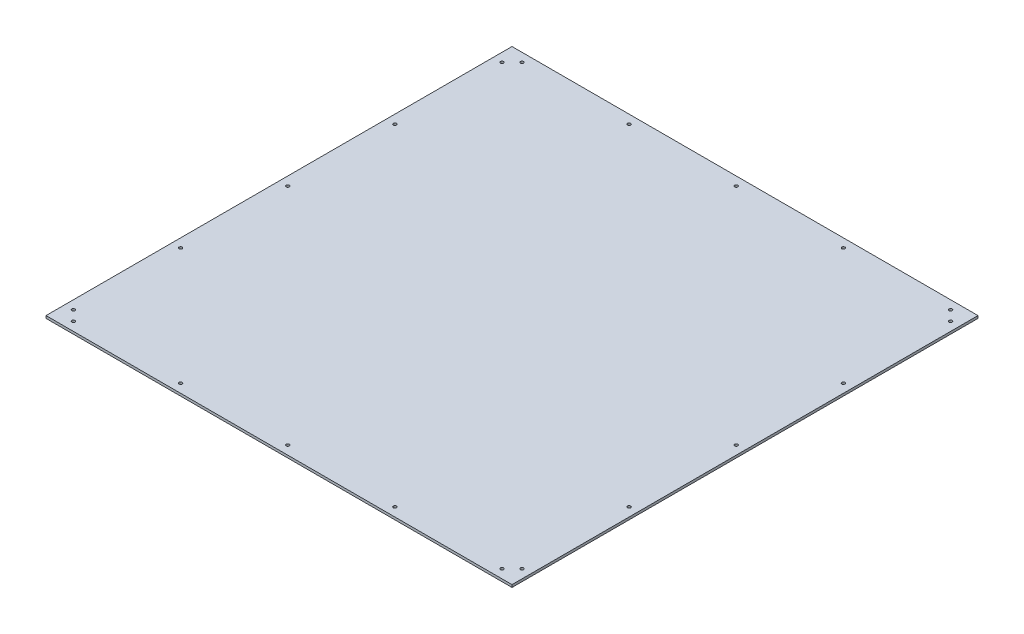
ISO-10303-21;
HEADER;
FILE_DESCRIPTION(('STEP AP214'),'2;1');
FILE_NAME('part.step','',(''),(''),'','','');
FILE_SCHEMA(('AUTOMOTIVE_DESIGN { 1 0 10303 214 1 1 1 1 }'));
ENDSEC;
DATA;
#1=APPLICATION_CONTEXT('core data for automotive mechanical design processes');
#2=APPLICATION_PROTOCOL_DEFINITION('international standard','automotive_design',2000,#1);
#3=PRODUCT_CONTEXT('',#1,'mechanical');
#4=PRODUCT('Part','Part','',(#3));
#5=PRODUCT_RELATED_PRODUCT_CATEGORY('part','',(#4));
#6=PRODUCT_DEFINITION_FORMATION('','',#4);
#7=PRODUCT_DEFINITION_CONTEXT('part definition',#1,'design');
#8=PRODUCT_DEFINITION('design','',#6,#7);
#9=PRODUCT_DEFINITION_SHAPE('','',#8);
#10=(LENGTH_UNIT() NAMED_UNIT(*) SI_UNIT(.MILLI.,.METRE.));
#11=(NAMED_UNIT(*) PLANE_ANGLE_UNIT() SI_UNIT($,.RADIAN.));
#12=(NAMED_UNIT(*) SI_UNIT($,.STERADIAN.) SOLID_ANGLE_UNIT());
#13=UNCERTAINTY_MEASURE_WITH_UNIT(LENGTH_MEASURE(1.E-05),#10,'distance_accuracy_value','');
#14=(GEOMETRIC_REPRESENTATION_CONTEXT(3) GLOBAL_UNCERTAINTY_ASSIGNED_CONTEXT((#13)) GLOBAL_UNIT_ASSIGNED_CONTEXT((#10,
#11,#12)) REPRESENTATION_CONTEXT('',''));
#15=CARTESIAN_POINT('',(0.,0.,0.));
#16=DIRECTION('',(0.,0.,1.));
#17=DIRECTION('',(1.,0.,0.));
#18=AXIS2_PLACEMENT_3D('',#15,#16,#17);
#19=CARTESIAN_POINT('',(0.,4.,0.));
#20=DIRECTION('',(0.,-1.,0.));
#21=DIRECTION('',(0.,0.,-1.));
#22=AXIS2_PLACEMENT_3D('',#19,#20,#21);
#23=PLANE('',#22);
#24=DIRECTION('',(0.,0.,-1.));
#25=VECTOR('',#24,1.);
#26=CARTESIAN_POINT('',(374.,4.,374.));
#27=LINE('',#26,#25);
#28=CARTESIAN_POINT('',(374.,4.,374.));
#29=VERTEX_POINT('',#28);
#30=CARTESIAN_POINT('',(374.,4.,-374.));
#31=VERTEX_POINT('',#30);
#32=EDGE_CURVE('E96',#29,#31,#27,.T.);
#33=ORIENTED_EDGE('',*,*,#32,.T.);
#34=DIRECTION('',(-1.,0.,0.));
#35=VECTOR('',#34,1.);
#36=CARTESIAN_POINT('',(-374.,4.,-374.));
#37=LINE('',#36,#35);
#38=CARTESIAN_POINT('',(-374.,4.,-374.));
#39=VERTEX_POINT('',#38);
#40=EDGE_CURVE('E91',#31,#39,#37,.T.);
#41=ORIENTED_EDGE('',*,*,#40,.T.);
#42=DIRECTION('',(0.,0.,1.));
#43=VECTOR('',#42,1.);
#44=CARTESIAN_POINT('',(-374.,4.,374.));
#45=LINE('',#44,#43);
#46=CARTESIAN_POINT('',(-374.,4.,374.));
#47=VERTEX_POINT('',#46);
#48=EDGE_CURVE('E94',#39,#47,#45,.T.);
#49=ORIENTED_EDGE('',*,*,#48,.T.);
#50=DIRECTION('',(1.,0.,0.));
#51=VECTOR('',#50,1.);
#52=CARTESIAN_POINT('',(-374.,4.,374.));
#53=LINE('',#52,#51);
#54=EDGE_CURVE('E61',#47,#29,#53,.T.);
#55=ORIENTED_EDGE('',*,*,#54,.T.);
#56=EDGE_LOOP('',(#33,#41,#49,#55));
#57=FACE_BOUND('',#56,.T.);
#58=CARTESIAN_POINT('',(-344.,4.,-360.));
#59=DIRECTION('',(0.,1.,0.));
#60=DIRECTION('',(0.,0.,1.));
#61=AXIS2_PLACEMENT_3D('',#58,#59,#60);
#62=CIRCLE('',#61,2.50000000000002);
#63=CARTESIAN_POINT('',(-344.,4.,-357.5));
#64=VERTEX_POINT('',#63);
#65=EDGE_CURVE('E118',#64,#64,#62,.T.);
#66=ORIENTED_EDGE('',*,*,#65,.F.);
#67=EDGE_LOOP('',(#66));
#68=FACE_BOUND('',#67,.T.);
#69=CARTESIAN_POINT('',(-172.,4.,-360.));
#70=DIRECTION('',(0.,1.,0.));
#71=DIRECTION('',(0.,0.,1.));
#72=AXIS2_PLACEMENT_3D('',#69,#70,#71);
#73=CIRCLE('',#72,2.5);
#74=CARTESIAN_POINT('',(-172.,4.,-357.5));
#75=VERTEX_POINT('',#74);
#76=EDGE_CURVE('E144',#75,#75,#73,.T.);
#77=ORIENTED_EDGE('',*,*,#76,.F.);
#78=EDGE_LOOP('',(#77));
#79=FACE_BOUND('',#78,.T.);
#80=CARTESIAN_POINT('',(0.,4.,-360.));
#81=DIRECTION('',(0.,1.,0.));
#82=DIRECTION('',(0.,0.,1.));
#83=AXIS2_PLACEMENT_3D('',#80,#81,#82);
#84=CIRCLE('',#83,2.5);
#85=CARTESIAN_POINT('',(0.,4.,-357.5));
#86=VERTEX_POINT('',#85);
#87=EDGE_CURVE('E152',#86,#86,#84,.T.);
#88=ORIENTED_EDGE('',*,*,#87,.F.);
#89=EDGE_LOOP('',(#88));
#90=FACE_BOUND('',#89,.T.);
#91=CARTESIAN_POINT('',(-360.,4.,1.11022302462516E-13));
#92=DIRECTION('',(0.,1.,0.));
#93=DIRECTION('',(0.,0.,-1.));
#94=AXIS2_PLACEMENT_3D('',#91,#92,#93);
#95=CIRCLE('',#94,2.50000000000002);
#96=CARTESIAN_POINT('',(-360.,4.,-2.49999999999991));
#97=VERTEX_POINT('',#96);
#98=EDGE_CURVE('E160',#97,#97,#95,.T.);
#99=ORIENTED_EDGE('',*,*,#98,.F.);
#100=EDGE_LOOP('',(#99));
#101=FACE_BOUND('',#100,.T.);
#102=CARTESIAN_POINT('',(-360.,4.,-172.));
#103=DIRECTION('',(0.,1.,0.));
#104=DIRECTION('',(0.,0.,-1.));
#105=AXIS2_PLACEMENT_3D('',#102,#103,#104);
#106=CIRCLE('',#105,2.50000000000002);
#107=CARTESIAN_POINT('',(-360.,4.,-174.5));
#108=VERTEX_POINT('',#107);
#109=EDGE_CURVE('E168',#108,#108,#106,.T.);
#110=ORIENTED_EDGE('',*,*,#109,.F.);
#111=EDGE_LOOP('',(#110));
#112=FACE_BOUND('',#111,.T.);
#113=CARTESIAN_POINT('',(-360.,4.,-343.999999999999));
#114=DIRECTION('',(0.,1.,0.));
#115=DIRECTION('',(0.,0.,-1.));
#116=AXIS2_PLACEMENT_3D('',#113,#114,#115);
#117=CIRCLE('',#116,2.50000000000002);
#118=CARTESIAN_POINT('',(-360.,4.,-346.499999999999));
#119=VERTEX_POINT('',#118);
#120=EDGE_CURVE('E176',#119,#119,#117,.T.);
#121=ORIENTED_EDGE('',*,*,#120,.F.);
#122=EDGE_LOOP('',(#121));
#123=FACE_BOUND('',#122,.T.);
#124=CARTESIAN_POINT('',(360.,4.,0.));
#125=DIRECTION('',(0.,1.,0.));
#126=DIRECTION('',(0.,0.,1.));
#127=AXIS2_PLACEMENT_3D('',#124,#125,#126);
#128=CIRCLE('',#127,2.50000000000002);
#129=CARTESIAN_POINT('',(360.,4.,2.50000000000004));
#130=VERTEX_POINT('',#129);
#131=EDGE_CURVE('E184',#130,#130,#128,.T.);
#132=ORIENTED_EDGE('',*,*,#131,.F.);
#133=EDGE_LOOP('',(#132));
#134=FACE_BOUND('',#133,.T.);
#135=CARTESIAN_POINT('',(172.,4.,-360.));
#136=DIRECTION('',(0.,1.,0.));
#137=DIRECTION('',(0.,0.,-1.));
#138=AXIS2_PLACEMENT_3D('',#135,#136,#137);
#139=CIRCLE('',#138,2.5);
#140=CARTESIAN_POINT('',(172.,4.,-362.5));
#141=VERTEX_POINT('',#140);
#142=EDGE_CURVE('E192',#141,#141,#139,.T.);
#143=ORIENTED_EDGE('',*,*,#142,.F.);
#144=EDGE_LOOP('',(#143));
#145=FACE_BOUND('',#144,.T.);
#146=CARTESIAN_POINT('',(360.,4.,-344.));
#147=DIRECTION('',(0.,1.,0.));
#148=DIRECTION('',(0.,0.,1.));
#149=AXIS2_PLACEMENT_3D('',#146,#147,#148);
#150=CIRCLE('',#149,2.50000000000002);
#151=CARTESIAN_POINT('',(360.,4.,-341.5));
#152=VERTEX_POINT('',#151);
#153=EDGE_CURVE('E200',#152,#152,#150,.T.);
#154=ORIENTED_EDGE('',*,*,#153,.F.);
#155=EDGE_LOOP('',(#154));
#156=FACE_BOUND('',#155,.T.);
#157=CARTESIAN_POINT('',(360.,4.,-172.));
#158=DIRECTION('',(0.,1.,0.));
#159=DIRECTION('',(0.,0.,1.));
#160=AXIS2_PLACEMENT_3D('',#157,#158,#159);
#161=CIRCLE('',#160,2.50000000000002);
#162=CARTESIAN_POINT('',(360.,4.,-169.5));
#163=VERTEX_POINT('',#162);
#164=EDGE_CURVE('E208',#163,#163,#161,.T.);
#165=ORIENTED_EDGE('',*,*,#164,.F.);
#166=EDGE_LOOP('',(#165));
#167=FACE_BOUND('',#166,.T.);
#168=CARTESIAN_POINT('',(344.,4.,-360.));
#169=DIRECTION('',(0.,1.,0.));
#170=DIRECTION('',(0.,0.,-1.));
#171=AXIS2_PLACEMENT_3D('',#168,#169,#170);
#172=CIRCLE('',#171,2.50000000000002);
#173=CARTESIAN_POINT('',(344.,4.,-362.5));
#174=VERTEX_POINT('',#173);
#175=EDGE_CURVE('E216',#174,#174,#172,.T.);
#176=ORIENTED_EDGE('',*,*,#175,.F.);
#177=EDGE_LOOP('',(#176));
#178=FACE_BOUND('',#177,.T.);
#179=CARTESIAN_POINT('',(360.,4.,172.));
#180=DIRECTION('',(0.,1.,0.));
#181=DIRECTION('',(0.,0.,-1.));
#182=AXIS2_PLACEMENT_3D('',#179,#180,#181);
#183=CIRCLE('',#182,2.50000000000002);
#184=CARTESIAN_POINT('',(360.,4.,169.5));
#185=VERTEX_POINT('',#184);
#186=EDGE_CURVE('E224',#185,#185,#183,.T.);
#187=ORIENTED_EDGE('',*,*,#186,.F.);
#188=EDGE_LOOP('',(#187));
#189=FACE_BOUND('',#188,.T.);
#190=CARTESIAN_POINT('',(360.,4.,344.));
#191=DIRECTION('',(0.,1.,0.));
#192=DIRECTION('',(0.,0.,-1.));
#193=AXIS2_PLACEMENT_3D('',#190,#191,#192);
#194=CIRCLE('',#193,2.50000000000002);
#195=CARTESIAN_POINT('',(360.,4.,341.5));
#196=VERTEX_POINT('',#195);
#197=EDGE_CURVE('E232',#196,#196,#194,.T.);
#198=ORIENTED_EDGE('',*,*,#197,.F.);
#199=EDGE_LOOP('',(#198));
#200=FACE_BOUND('',#199,.T.);
#201=CARTESIAN_POINT('',(344.,4.,360.));
#202=DIRECTION('',(0.,1.,0.));
#203=DIRECTION('',(0.,0.,1.));
#204=AXIS2_PLACEMENT_3D('',#201,#202,#203);
#205=CIRCLE('',#204,2.50000000000002);
#206=CARTESIAN_POINT('',(344.,4.,362.5));
#207=VERTEX_POINT('',#206);
#208=EDGE_CURVE('E240',#207,#207,#205,.T.);
#209=ORIENTED_EDGE('',*,*,#208,.F.);
#210=EDGE_LOOP('',(#209));
#211=FACE_BOUND('',#210,.T.);
#212=CARTESIAN_POINT('',(172.,4.,360.));
#213=DIRECTION('',(0.,1.,0.));
#214=DIRECTION('',(0.,0.,1.));
#215=AXIS2_PLACEMENT_3D('',#212,#213,#214);
#216=CIRCLE('',#215,2.5);
#217=CARTESIAN_POINT('',(172.,4.,362.5));
#218=VERTEX_POINT('',#217);
#219=EDGE_CURVE('E248',#218,#218,#216,.T.);
#220=ORIENTED_EDGE('',*,*,#219,.F.);
#221=EDGE_LOOP('',(#220));
#222=FACE_BOUND('',#221,.T.);
#223=CARTESIAN_POINT('',(0.,4.,360.));
#224=DIRECTION('',(0.,1.,0.));
#225=DIRECTION('',(0.,0.,-1.));
#226=AXIS2_PLACEMENT_3D('',#223,#224,#225);
#227=CIRCLE('',#226,2.5);
#228=CARTESIAN_POINT('',(0.,4.,357.5));
#229=VERTEX_POINT('',#228);
#230=EDGE_CURVE('E256',#229,#229,#227,.T.);
#231=ORIENTED_EDGE('',*,*,#230,.F.);
#232=EDGE_LOOP('',(#231));
#233=FACE_BOUND('',#232,.T.);
#234=CARTESIAN_POINT('',(-172.,4.,360.));
#235=DIRECTION('',(0.,1.,0.));
#236=DIRECTION('',(0.,0.,-1.));
#237=AXIS2_PLACEMENT_3D('',#234,#235,#236);
#238=CIRCLE('',#237,2.5);
#239=CARTESIAN_POINT('',(-172.,4.,357.5));
#240=VERTEX_POINT('',#239);
#241=EDGE_CURVE('E264',#240,#240,#238,.T.);
#242=ORIENTED_EDGE('',*,*,#241,.F.);
#243=EDGE_LOOP('',(#242));
#244=FACE_BOUND('',#243,.T.);
#245=CARTESIAN_POINT('',(-344.,4.,360.));
#246=DIRECTION('',(0.,1.,0.));
#247=DIRECTION('',(0.,0.,-1.));
#248=AXIS2_PLACEMENT_3D('',#245,#246,#247);
#249=CIRCLE('',#248,2.50000000000002);
#250=CARTESIAN_POINT('',(-344.,4.,357.5));
#251=VERTEX_POINT('',#250);
#252=EDGE_CURVE('E272',#251,#251,#249,.T.);
#253=ORIENTED_EDGE('',*,*,#252,.F.);
#254=EDGE_LOOP('',(#253));
#255=FACE_BOUND('',#254,.T.);
#256=CARTESIAN_POINT('',(-360.,4.,343.999999999999));
#257=DIRECTION('',(0.,1.,0.));
#258=DIRECTION('',(0.,0.,1.));
#259=AXIS2_PLACEMENT_3D('',#256,#257,#258);
#260=CIRCLE('',#259,2.50000000000002);
#261=CARTESIAN_POINT('',(-360.,4.,346.499999999999));
#262=VERTEX_POINT('',#261);
#263=EDGE_CURVE('E280',#262,#262,#260,.T.);
#264=ORIENTED_EDGE('',*,*,#263,.F.);
#265=EDGE_LOOP('',(#264));
#266=FACE_BOUND('',#265,.T.);
#267=CARTESIAN_POINT('',(-360.,4.,172.));
#268=DIRECTION('',(0.,1.,0.));
#269=DIRECTION('',(0.,0.,1.));
#270=AXIS2_PLACEMENT_3D('',#267,#268,#269);
#271=CIRCLE('',#270,2.50000000000002);
#272=CARTESIAN_POINT('',(-360.,4.,174.5));
#273=VERTEX_POINT('',#272);
#274=EDGE_CURVE('E288',#273,#273,#271,.T.);
#275=ORIENTED_EDGE('',*,*,#274,.F.);
#276=EDGE_LOOP('',(#275));
#277=FACE_BOUND('',#276,.T.);
#278=ADVANCED_FACE('F43',(#57,#68,#79,#90,#101,#112,#123,#134,#145,#156,#167,#178,#189,#200,
#211,#222,#233,#244,#255,#266,#277),#23,.F.);
#279=CARTESIAN_POINT('',(0.,0.,0.));
#280=DIRECTION('',(0.,-1.,0.));
#281=DIRECTION('',(0.,0.,-1.));
#282=AXIS2_PLACEMENT_3D('',#279,#280,#281);
#283=PLANE('',#282);
#284=CARTESIAN_POINT('',(-360.,0.,343.999999999999));
#285=DIRECTION('',(0.,1.,0.));
#286=DIRECTION('',(0.,0.,1.));
#287=AXIS2_PLACEMENT_3D('',#284,#285,#286);
#288=CIRCLE('',#287,2.50000000000002);
#289=CARTESIAN_POINT('',(-360.,0.,346.499999999999));
#290=VERTEX_POINT('',#289);
#291=EDGE_CURVE('E284',#290,#290,#288,.T.);
#292=ORIENTED_EDGE('',*,*,#291,.T.);
#293=EDGE_LOOP('',(#292));
#294=FACE_BOUND('',#293,.T.);
#295=CARTESIAN_POINT('',(-172.,0.,360.));
#296=DIRECTION('',(0.,1.,0.));
#297=DIRECTION('',(0.,0.,-1.));
#298=AXIS2_PLACEMENT_3D('',#295,#296,#297);
#299=CIRCLE('',#298,2.5);
#300=CARTESIAN_POINT('',(-172.,0.,357.5));
#301=VERTEX_POINT('',#300);
#302=EDGE_CURVE('E268',#301,#301,#299,.T.);
#303=ORIENTED_EDGE('',*,*,#302,.T.);
#304=EDGE_LOOP('',(#303));
#305=FACE_BOUND('',#304,.T.);
#306=CARTESIAN_POINT('',(172.,0.,360.));
#307=DIRECTION('',(0.,1.,0.));
#308=DIRECTION('',(0.,0.,1.));
#309=AXIS2_PLACEMENT_3D('',#306,#307,#308);
#310=CIRCLE('',#309,2.5);
#311=CARTESIAN_POINT('',(172.,0.,362.5));
#312=VERTEX_POINT('',#311);
#313=EDGE_CURVE('E252',#312,#312,#310,.T.);
#314=ORIENTED_EDGE('',*,*,#313,.T.);
#315=EDGE_LOOP('',(#314));
#316=FACE_BOUND('',#315,.T.);
#317=CARTESIAN_POINT('',(360.,0.,344.));
#318=DIRECTION('',(0.,1.,0.));
#319=DIRECTION('',(0.,0.,-1.));
#320=AXIS2_PLACEMENT_3D('',#317,#318,#319);
#321=CIRCLE('',#320,2.50000000000002);
#322=CARTESIAN_POINT('',(360.,0.,341.5));
#323=VERTEX_POINT('',#322);
#324=EDGE_CURVE('E236',#323,#323,#321,.T.);
#325=ORIENTED_EDGE('',*,*,#324,.T.);
#326=EDGE_LOOP('',(#325));
#327=FACE_BOUND('',#326,.T.);
#328=CARTESIAN_POINT('',(344.,0.,-360.));
#329=DIRECTION('',(0.,1.,0.));
#330=DIRECTION('',(0.,0.,-1.));
#331=AXIS2_PLACEMENT_3D('',#328,#329,#330);
#332=CIRCLE('',#331,2.50000000000002);
#333=CARTESIAN_POINT('',(344.,0.,-362.5));
#334=VERTEX_POINT('',#333);
#335=EDGE_CURVE('E220',#334,#334,#332,.T.);
#336=ORIENTED_EDGE('',*,*,#335,.T.);
#337=EDGE_LOOP('',(#336));
#338=FACE_BOUND('',#337,.T.);
#339=CARTESIAN_POINT('',(360.,0.,-344.));
#340=DIRECTION('',(0.,1.,0.));
#341=DIRECTION('',(0.,0.,1.));
#342=AXIS2_PLACEMENT_3D('',#339,#340,#341);
#343=CIRCLE('',#342,2.50000000000002);
#344=CARTESIAN_POINT('',(360.,0.,-341.5));
#345=VERTEX_POINT('',#344);
#346=EDGE_CURVE('E204',#345,#345,#343,.T.);
#347=ORIENTED_EDGE('',*,*,#346,.T.);
#348=EDGE_LOOP('',(#347));
#349=FACE_BOUND('',#348,.T.);
#350=CARTESIAN_POINT('',(360.,0.,0.));
#351=DIRECTION('',(0.,1.,0.));
#352=DIRECTION('',(0.,0.,1.));
#353=AXIS2_PLACEMENT_3D('',#350,#351,#352);
#354=CIRCLE('',#353,2.50000000000002);
#355=CARTESIAN_POINT('',(360.,0.,2.50000000000004));
#356=VERTEX_POINT('',#355);
#357=EDGE_CURVE('E188',#356,#356,#354,.T.);
#358=ORIENTED_EDGE('',*,*,#357,.T.);
#359=EDGE_LOOP('',(#358));
#360=FACE_BOUND('',#359,.T.);
#361=CARTESIAN_POINT('',(-360.,0.,-172.));
#362=DIRECTION('',(0.,1.,0.));
#363=DIRECTION('',(0.,0.,-1.));
#364=AXIS2_PLACEMENT_3D('',#361,#362,#363);
#365=CIRCLE('',#364,2.50000000000002);
#366=CARTESIAN_POINT('',(-360.,0.,-174.5));
#367=VERTEX_POINT('',#366);
#368=EDGE_CURVE('E172',#367,#367,#365,.T.);
#369=ORIENTED_EDGE('',*,*,#368,.T.);
#370=EDGE_LOOP('',(#369));
#371=FACE_BOUND('',#370,.T.);
#372=CARTESIAN_POINT('',(0.,0.,-360.));
#373=DIRECTION('',(0.,1.,0.));
#374=DIRECTION('',(0.,0.,1.));
#375=AXIS2_PLACEMENT_3D('',#372,#373,#374);
#376=CIRCLE('',#375,2.5);
#377=CARTESIAN_POINT('',(0.,0.,-357.5));
#378=VERTEX_POINT('',#377);
#379=EDGE_CURVE('E156',#378,#378,#376,.T.);
#380=ORIENTED_EDGE('',*,*,#379,.T.);
#381=EDGE_LOOP('',(#380));
#382=FACE_BOUND('',#381,.T.);
#383=CARTESIAN_POINT('',(-344.,0.,-360.));
#384=DIRECTION('',(0.,1.,0.));
#385=DIRECTION('',(0.,0.,1.));
#386=AXIS2_PLACEMENT_3D('',#383,#384,#385);
#387=CIRCLE('',#386,2.50000000000002);
#388=CARTESIAN_POINT('',(-344.,0.,-357.5));
#389=VERTEX_POINT('',#388);
#390=EDGE_CURVE('E140',#389,#389,#387,.T.);
#391=ORIENTED_EDGE('',*,*,#390,.T.);
#392=EDGE_LOOP('',(#391));
#393=FACE_BOUND('',#392,.T.);
#394=DIRECTION('',(0.,0.,-1.));
#395=VECTOR('',#394,1.);
#396=CARTESIAN_POINT('',(374.,0.,374.));
#397=LINE('',#396,#395);
#398=CARTESIAN_POINT('',(374.,0.,374.));
#399=VERTEX_POINT('',#398);
#400=CARTESIAN_POINT('',(374.,0.,-374.));
#401=VERTEX_POINT('',#400);
#402=EDGE_CURVE('E114',#399,#401,#397,.T.);
#403=ORIENTED_EDGE('',*,*,#402,.F.);
#404=DIRECTION('',(1.,0.,0.));
#405=VECTOR('',#404,1.);
#406=CARTESIAN_POINT('',(-374.,0.,374.));
#407=LINE('',#406,#405);
#408=CARTESIAN_POINT('',(-374.,0.,374.));
#409=VERTEX_POINT('',#408);
#410=EDGE_CURVE('E84',#409,#399,#407,.T.);
#411=ORIENTED_EDGE('',*,*,#410,.F.);
#412=DIRECTION('',(0.,0.,1.));
#413=VECTOR('',#412,1.);
#414=CARTESIAN_POINT('',(-374.,0.,374.));
#415=LINE('',#414,#413);
#416=CARTESIAN_POINT('',(-374.,0.,-374.));
#417=VERTEX_POINT('',#416);
#418=EDGE_CURVE('E78',#417,#409,#415,.T.);
#419=ORIENTED_EDGE('',*,*,#418,.F.);
#420=DIRECTION('',(-1.,0.,0.));
#421=VECTOR('',#420,1.);
#422=CARTESIAN_POINT('',(-374.,0.,-374.));
#423=LINE('',#422,#421);
#424=EDGE_CURVE('E101',#401,#417,#423,.T.);
#425=ORIENTED_EDGE('',*,*,#424,.F.);
#426=EDGE_LOOP('',(#403,#411,#419,#425));
#427=FACE_BOUND('',#426,.T.);
#428=CARTESIAN_POINT('',(-172.,0.,-360.));
#429=DIRECTION('',(0.,1.,0.));
#430=DIRECTION('',(0.,0.,1.));
#431=AXIS2_PLACEMENT_3D('',#428,#429,#430);
#432=CIRCLE('',#431,2.5);
#433=CARTESIAN_POINT('',(-172.,0.,-357.5));
#434=VERTEX_POINT('',#433);
#435=EDGE_CURVE('E148',#434,#434,#432,.T.);
#436=ORIENTED_EDGE('',*,*,#435,.T.);
#437=EDGE_LOOP('',(#436));
#438=FACE_BOUND('',#437,.T.);
#439=CARTESIAN_POINT('',(-360.,0.,1.11022302462516E-13));
#440=DIRECTION('',(0.,1.,0.));
#441=DIRECTION('',(0.,0.,-1.));
#442=AXIS2_PLACEMENT_3D('',#439,#440,#441);
#443=CIRCLE('',#442,2.50000000000002);
#444=CARTESIAN_POINT('',(-360.,0.,-2.49999999999991));
#445=VERTEX_POINT('',#444);
#446=EDGE_CURVE('E164',#445,#445,#443,.T.);
#447=ORIENTED_EDGE('',*,*,#446,.T.);
#448=EDGE_LOOP('',(#447));
#449=FACE_BOUND('',#448,.T.);
#450=CARTESIAN_POINT('',(-360.,0.,-343.999999999999));
#451=DIRECTION('',(0.,1.,0.));
#452=DIRECTION('',(0.,0.,-1.));
#453=AXIS2_PLACEMENT_3D('',#450,#451,#452);
#454=CIRCLE('',#453,2.50000000000002);
#455=CARTESIAN_POINT('',(-360.,0.,-346.499999999999));
#456=VERTEX_POINT('',#455);
#457=EDGE_CURVE('E180',#456,#456,#454,.T.);
#458=ORIENTED_EDGE('',*,*,#457,.T.);
#459=EDGE_LOOP('',(#458));
#460=FACE_BOUND('',#459,.T.);
#461=CARTESIAN_POINT('',(172.,0.,-360.));
#462=DIRECTION('',(0.,1.,0.));
#463=DIRECTION('',(0.,0.,-1.));
#464=AXIS2_PLACEMENT_3D('',#461,#462,#463);
#465=CIRCLE('',#464,2.5);
#466=CARTESIAN_POINT('',(172.,0.,-362.5));
#467=VERTEX_POINT('',#466);
#468=EDGE_CURVE('E196',#467,#467,#465,.T.);
#469=ORIENTED_EDGE('',*,*,#468,.T.);
#470=EDGE_LOOP('',(#469));
#471=FACE_BOUND('',#470,.T.);
#472=CARTESIAN_POINT('',(360.,0.,-172.));
#473=DIRECTION('',(0.,1.,0.));
#474=DIRECTION('',(0.,0.,1.));
#475=AXIS2_PLACEMENT_3D('',#472,#473,#474);
#476=CIRCLE('',#475,2.50000000000002);
#477=CARTESIAN_POINT('',(360.,0.,-169.5));
#478=VERTEX_POINT('',#477);
#479=EDGE_CURVE('E212',#478,#478,#476,.T.);
#480=ORIENTED_EDGE('',*,*,#479,.T.);
#481=EDGE_LOOP('',(#480));
#482=FACE_BOUND('',#481,.T.);
#483=CARTESIAN_POINT('',(360.,0.,172.));
#484=DIRECTION('',(0.,1.,0.));
#485=DIRECTION('',(0.,0.,-1.));
#486=AXIS2_PLACEMENT_3D('',#483,#484,#485);
#487=CIRCLE('',#486,2.50000000000002);
#488=CARTESIAN_POINT('',(360.,0.,169.5));
#489=VERTEX_POINT('',#488);
#490=EDGE_CURVE('E228',#489,#489,#487,.T.);
#491=ORIENTED_EDGE('',*,*,#490,.T.);
#492=EDGE_LOOP('',(#491));
#493=FACE_BOUND('',#492,.T.);
#494=CARTESIAN_POINT('',(344.,0.,360.));
#495=DIRECTION('',(0.,1.,0.));
#496=DIRECTION('',(0.,0.,1.));
#497=AXIS2_PLACEMENT_3D('',#494,#495,#496);
#498=CIRCLE('',#497,2.50000000000002);
#499=CARTESIAN_POINT('',(344.,0.,362.5));
#500=VERTEX_POINT('',#499);
#501=EDGE_CURVE('E244',#500,#500,#498,.T.);
#502=ORIENTED_EDGE('',*,*,#501,.T.);
#503=EDGE_LOOP('',(#502));
#504=FACE_BOUND('',#503,.T.);
#505=CARTESIAN_POINT('',(0.,0.,360.));
#506=DIRECTION('',(0.,1.,0.));
#507=DIRECTION('',(0.,0.,-1.));
#508=AXIS2_PLACEMENT_3D('',#505,#506,#507);
#509=CIRCLE('',#508,2.5);
#510=CARTESIAN_POINT('',(0.,0.,357.5));
#511=VERTEX_POINT('',#510);
#512=EDGE_CURVE('E260',#511,#511,#509,.T.);
#513=ORIENTED_EDGE('',*,*,#512,.T.);
#514=EDGE_LOOP('',(#513));
#515=FACE_BOUND('',#514,.T.);
#516=CARTESIAN_POINT('',(-344.,0.,360.));
#517=DIRECTION('',(0.,1.,0.));
#518=DIRECTION('',(0.,0.,-1.));
#519=AXIS2_PLACEMENT_3D('',#516,#517,#518);
#520=CIRCLE('',#519,2.50000000000002);
#521=CARTESIAN_POINT('',(-344.,0.,357.5));
#522=VERTEX_POINT('',#521);
#523=EDGE_CURVE('E276',#522,#522,#520,.T.);
#524=ORIENTED_EDGE('',*,*,#523,.T.);
#525=EDGE_LOOP('',(#524));
#526=FACE_BOUND('',#525,.T.);
#527=CARTESIAN_POINT('',(-360.,0.,172.));
#528=DIRECTION('',(0.,1.,0.));
#529=DIRECTION('',(0.,0.,1.));
#530=AXIS2_PLACEMENT_3D('',#527,#528,#529);
#531=CIRCLE('',#530,2.50000000000002);
#532=CARTESIAN_POINT('',(-360.,0.,174.5));
#533=VERTEX_POINT('',#532);
#534=EDGE_CURVE('E292',#533,#533,#531,.T.);
#535=ORIENTED_EDGE('',*,*,#534,.T.);
#536=EDGE_LOOP('',(#535));
#537=FACE_BOUND('',#536,.T.);
#538=ADVANCED_FACE('F133',(#294,#305,#316,#327,#338,#349,#360,#371,#382,#393,#427,#438,#449,
#460,#471,#482,#493,#504,#515,#526,#537),#283,.T.);
#539=CARTESIAN_POINT('',(374.,4.,374.));
#540=DIRECTION('',(-1.,0.,0.));
#541=DIRECTION('',(0.,0.,1.));
#542=AXIS2_PLACEMENT_3D('',#539,#540,#541);
#543=PLANE('',#542);
#544=ORIENTED_EDGE('',*,*,#402,.T.);
#545=DIRECTION('',(0.,-1.,0.));
#546=VECTOR('',#545,1.);
#547=CARTESIAN_POINT('',(374.,4.,-374.));
#548=LINE('',#547,#546);
#549=EDGE_CURVE('E11',#31,#401,#548,.T.);
#550=ORIENTED_EDGE('',*,*,#549,.F.);
#551=ORIENTED_EDGE('',*,*,#32,.F.);
#552=DIRECTION('',(0.,-1.,0.));
#553=VECTOR('',#552,1.);
#554=CARTESIAN_POINT('',(374.,4.,374.));
#555=LINE('',#554,#553);
#556=EDGE_CURVE('E110',#29,#399,#555,.T.);
#557=ORIENTED_EDGE('',*,*,#556,.T.);
#558=EDGE_LOOP('',(#544,#550,#551,#557));
#559=FACE_BOUND('',#558,.T.);
#560=ADVANCED_FACE('F45',(#559),#543,.F.);
#561=CARTESIAN_POINT('',(-374.,4.,-374.));
#562=DIRECTION('',(0.,0.,1.));
#563=DIRECTION('',(1.,0.,0.));
#564=AXIS2_PLACEMENT_3D('',#561,#562,#563);
#565=PLANE('',#564);
#566=ORIENTED_EDGE('',*,*,#424,.T.);
#567=DIRECTION('',(0.,-1.,0.));
#568=VECTOR('',#567,1.);
#569=CARTESIAN_POINT('',(-374.,4.,-374.));
#570=LINE('',#569,#568);
#571=EDGE_CURVE('E53',#39,#417,#570,.T.);
#572=ORIENTED_EDGE('',*,*,#571,.F.);
#573=ORIENTED_EDGE('',*,*,#40,.F.);
#574=ORIENTED_EDGE('',*,*,#549,.T.);
#575=EDGE_LOOP('',(#566,#572,#573,#574));
#576=FACE_BOUND('',#575,.T.);
#577=ADVANCED_FACE('F100',(#576),#565,.F.);
#578=CARTESIAN_POINT('',(-374.,4.,374.));
#579=DIRECTION('',(1.,0.,0.));
#580=DIRECTION('',(0.,0.,-1.));
#581=AXIS2_PLACEMENT_3D('',#578,#579,#580);
#582=PLANE('',#581);
#583=ORIENTED_EDGE('',*,*,#418,.T.);
#584=DIRECTION('',(0.,-1.,0.));
#585=VECTOR('',#584,1.);
#586=CARTESIAN_POINT('',(-374.,4.,374.));
#587=LINE('',#586,#585);
#588=EDGE_CURVE('E103',#47,#409,#587,.T.);
#589=ORIENTED_EDGE('',*,*,#588,.F.);
#590=ORIENTED_EDGE('',*,*,#48,.F.);
#591=ORIENTED_EDGE('',*,*,#571,.T.);
#592=EDGE_LOOP('',(#583,#589,#590,#591));
#593=FACE_BOUND('',#592,.T.);
#594=ADVANCED_FACE('F104',(#593),#582,.F.);
#595=CARTESIAN_POINT('',(-374.,4.,374.));
#596=DIRECTION('',(0.,0.,-1.));
#597=DIRECTION('',(-1.,0.,0.));
#598=AXIS2_PLACEMENT_3D('',#595,#596,#597);
#599=PLANE('',#598);
#600=ORIENTED_EDGE('',*,*,#410,.T.);
#601=ORIENTED_EDGE('',*,*,#556,.F.);
#602=ORIENTED_EDGE('',*,*,#54,.F.);
#603=ORIENTED_EDGE('',*,*,#588,.T.);
#604=EDGE_LOOP('',(#600,#601,#602,#603));
#605=FACE_BOUND('',#604,.T.);
#606=ADVANCED_FACE('F130',(#605),#599,.F.);
#607=CARTESIAN_POINT('',(-344.,4.,-360.));
#608=DIRECTION('',(0.,-1.,0.));
#609=DIRECTION('',(0.,0.,-1.));
#610=AXIS2_PLACEMENT_3D('',#607,#608,#609);
#611=CYLINDRICAL_SURFACE('',#610,2.50000000000002);
#612=ORIENTED_EDGE('',*,*,#65,.T.);
#613=EDGE_LOOP('',(#612));
#614=FACE_BOUND('',#613,.T.);
#615=ORIENTED_EDGE('',*,*,#390,.F.);
#616=EDGE_LOOP('',(#615));
#617=FACE_BOUND('',#616,.T.);
#618=ADVANCED_FACE('F313',(#614,#617),#611,.F.);
#619=CARTESIAN_POINT('',(-172.,4.,-360.));
#620=DIRECTION('',(0.,-1.,0.));
#621=DIRECTION('',(0.,0.,-1.));
#622=AXIS2_PLACEMENT_3D('',#619,#620,#621);
#623=CYLINDRICAL_SURFACE('',#622,2.5);
#624=ORIENTED_EDGE('',*,*,#76,.T.);
#625=EDGE_LOOP('',(#624));
#626=FACE_BOUND('',#625,.T.);
#627=ORIENTED_EDGE('',*,*,#435,.F.);
#628=EDGE_LOOP('',(#627));
#629=FACE_BOUND('',#628,.T.);
#630=ADVANCED_FACE('F368',(#626,#629),#623,.F.);
#631=CARTESIAN_POINT('',(0.,4.,-360.));
#632=DIRECTION('',(0.,-1.,0.));
#633=DIRECTION('',(0.,0.,-1.));
#634=AXIS2_PLACEMENT_3D('',#631,#632,#633);
#635=CYLINDRICAL_SURFACE('',#634,2.5);
#636=ORIENTED_EDGE('',*,*,#87,.T.);
#637=EDGE_LOOP('',(#636));
#638=FACE_BOUND('',#637,.T.);
#639=ORIENTED_EDGE('',*,*,#379,.F.);
#640=EDGE_LOOP('',(#639));
#641=FACE_BOUND('',#640,.T.);
#642=ADVANCED_FACE('F377',(#638,#641),#635,.F.);
#643=CARTESIAN_POINT('',(-360.,4.,1.11022302462516E-13));
#644=DIRECTION('',(0.,-1.,0.));
#645=DIRECTION('',(0.,0.,-1.));
#646=AXIS2_PLACEMENT_3D('',#643,#644,#645);
#647=CYLINDRICAL_SURFACE('',#646,2.50000000000002);
#648=ORIENTED_EDGE('',*,*,#98,.T.);
#649=EDGE_LOOP('',(#648));
#650=FACE_BOUND('',#649,.T.);
#651=ORIENTED_EDGE('',*,*,#446,.F.);
#652=EDGE_LOOP('',(#651));
#653=FACE_BOUND('',#652,.T.);
#654=ADVANCED_FACE('F386',(#650,#653),#647,.F.);
#655=CARTESIAN_POINT('',(-360.,4.,-172.));
#656=DIRECTION('',(0.,-1.,0.));
#657=DIRECTION('',(0.,0.,-1.));
#658=AXIS2_PLACEMENT_3D('',#655,#656,#657);
#659=CYLINDRICAL_SURFACE('',#658,2.50000000000002);
#660=ORIENTED_EDGE('',*,*,#109,.T.);
#661=EDGE_LOOP('',(#660));
#662=FACE_BOUND('',#661,.T.);
#663=ORIENTED_EDGE('',*,*,#368,.F.);
#664=EDGE_LOOP('',(#663));
#665=FACE_BOUND('',#664,.T.);
#666=ADVANCED_FACE('F396',(#662,#665),#659,.F.);
#667=CARTESIAN_POINT('',(-360.,4.,-343.999999999999));
#668=DIRECTION('',(0.,-1.,0.));
#669=DIRECTION('',(0.,0.,-1.));
#670=AXIS2_PLACEMENT_3D('',#667,#668,#669);
#671=CYLINDRICAL_SURFACE('',#670,2.50000000000002);
#672=ORIENTED_EDGE('',*,*,#120,.T.);
#673=EDGE_LOOP('',(#672));
#674=FACE_BOUND('',#673,.T.);
#675=ORIENTED_EDGE('',*,*,#457,.F.);
#676=EDGE_LOOP('',(#675));
#677=FACE_BOUND('',#676,.T.);
#678=ADVANCED_FACE('F406',(#674,#677),#671,.F.);
#679=CARTESIAN_POINT('',(360.,4.,0.));
#680=DIRECTION('',(0.,-1.,0.));
#681=DIRECTION('',(0.,0.,-1.));
#682=AXIS2_PLACEMENT_3D('',#679,#680,#681);
#683=CYLINDRICAL_SURFACE('',#682,2.50000000000002);
#684=ORIENTED_EDGE('',*,*,#131,.T.);
#685=EDGE_LOOP('',(#684));
#686=FACE_BOUND('',#685,.T.);
#687=ORIENTED_EDGE('',*,*,#357,.F.);
#688=EDGE_LOOP('',(#687));
#689=FACE_BOUND('',#688,.T.);
#690=ADVANCED_FACE('F416',(#686,#689),#683,.F.);
#691=CARTESIAN_POINT('',(172.,4.,-360.));
#692=DIRECTION('',(0.,-1.,0.));
#693=DIRECTION('',(0.,0.,-1.));
#694=AXIS2_PLACEMENT_3D('',#691,#692,#693);
#695=CYLINDRICAL_SURFACE('',#694,2.5);
#696=ORIENTED_EDGE('',*,*,#142,.T.);
#697=EDGE_LOOP('',(#696));
#698=FACE_BOUND('',#697,.T.);
#699=ORIENTED_EDGE('',*,*,#468,.F.);
#700=EDGE_LOOP('',(#699));
#701=FACE_BOUND('',#700,.T.);
#702=ADVANCED_FACE('F426',(#698,#701),#695,.F.);
#703=CARTESIAN_POINT('',(360.,4.,-344.));
#704=DIRECTION('',(0.,-1.,0.));
#705=DIRECTION('',(0.,0.,-1.));
#706=AXIS2_PLACEMENT_3D('',#703,#704,#705);
#707=CYLINDRICAL_SURFACE('',#706,2.50000000000002);
#708=ORIENTED_EDGE('',*,*,#153,.T.);
#709=EDGE_LOOP('',(#708));
#710=FACE_BOUND('',#709,.T.);
#711=ORIENTED_EDGE('',*,*,#346,.F.);
#712=EDGE_LOOP('',(#711));
#713=FACE_BOUND('',#712,.T.);
#714=ADVANCED_FACE('F436',(#710,#713),#707,.F.);
#715=CARTESIAN_POINT('',(360.,4.,-172.));
#716=DIRECTION('',(0.,-1.,0.));
#717=DIRECTION('',(0.,0.,-1.));
#718=AXIS2_PLACEMENT_3D('',#715,#716,#717);
#719=CYLINDRICAL_SURFACE('',#718,2.50000000000002);
#720=ORIENTED_EDGE('',*,*,#164,.T.);
#721=EDGE_LOOP('',(#720));
#722=FACE_BOUND('',#721,.T.);
#723=ORIENTED_EDGE('',*,*,#479,.F.);
#724=EDGE_LOOP('',(#723));
#725=FACE_BOUND('',#724,.T.);
#726=ADVANCED_FACE('F446',(#722,#725),#719,.F.);
#727=CARTESIAN_POINT('',(344.,4.,-360.));
#728=DIRECTION('',(0.,-1.,0.));
#729=DIRECTION('',(0.,0.,-1.));
#730=AXIS2_PLACEMENT_3D('',#727,#728,#729);
#731=CYLINDRICAL_SURFACE('',#730,2.50000000000002);
#732=ORIENTED_EDGE('',*,*,#175,.T.);
#733=EDGE_LOOP('',(#732));
#734=FACE_BOUND('',#733,.T.);
#735=ORIENTED_EDGE('',*,*,#335,.F.);
#736=EDGE_LOOP('',(#735));
#737=FACE_BOUND('',#736,.T.);
#738=ADVANCED_FACE('F456',(#734,#737),#731,.F.);
#739=CARTESIAN_POINT('',(360.,4.,172.));
#740=DIRECTION('',(0.,-1.,0.));
#741=DIRECTION('',(0.,0.,-1.));
#742=AXIS2_PLACEMENT_3D('',#739,#740,#741);
#743=CYLINDRICAL_SURFACE('',#742,2.50000000000002);
#744=ORIENTED_EDGE('',*,*,#186,.T.);
#745=EDGE_LOOP('',(#744));
#746=FACE_BOUND('',#745,.T.);
#747=ORIENTED_EDGE('',*,*,#490,.F.);
#748=EDGE_LOOP('',(#747));
#749=FACE_BOUND('',#748,.T.);
#750=ADVANCED_FACE('F466',(#746,#749),#743,.F.);
#751=CARTESIAN_POINT('',(360.,4.,344.));
#752=DIRECTION('',(0.,-1.,0.));
#753=DIRECTION('',(0.,0.,-1.));
#754=AXIS2_PLACEMENT_3D('',#751,#752,#753);
#755=CYLINDRICAL_SURFACE('',#754,2.50000000000002);
#756=ORIENTED_EDGE('',*,*,#197,.T.);
#757=EDGE_LOOP('',(#756));
#758=FACE_BOUND('',#757,.T.);
#759=ORIENTED_EDGE('',*,*,#324,.F.);
#760=EDGE_LOOP('',(#759));
#761=FACE_BOUND('',#760,.T.);
#762=ADVANCED_FACE('F476',(#758,#761),#755,.F.);
#763=CARTESIAN_POINT('',(344.,4.,360.));
#764=DIRECTION('',(0.,-1.,0.));
#765=DIRECTION('',(0.,0.,-1.));
#766=AXIS2_PLACEMENT_3D('',#763,#764,#765);
#767=CYLINDRICAL_SURFACE('',#766,2.50000000000002);
#768=ORIENTED_EDGE('',*,*,#208,.T.);
#769=EDGE_LOOP('',(#768));
#770=FACE_BOUND('',#769,.T.);
#771=ORIENTED_EDGE('',*,*,#501,.F.);
#772=EDGE_LOOP('',(#771));
#773=FACE_BOUND('',#772,.T.);
#774=ADVANCED_FACE('F486',(#770,#773),#767,.F.);
#775=CARTESIAN_POINT('',(172.,4.,360.));
#776=DIRECTION('',(0.,-1.,0.));
#777=DIRECTION('',(0.,0.,-1.));
#778=AXIS2_PLACEMENT_3D('',#775,#776,#777);
#779=CYLINDRICAL_SURFACE('',#778,2.5);
#780=ORIENTED_EDGE('',*,*,#219,.T.);
#781=EDGE_LOOP('',(#780));
#782=FACE_BOUND('',#781,.T.);
#783=ORIENTED_EDGE('',*,*,#313,.F.);
#784=EDGE_LOOP('',(#783));
#785=FACE_BOUND('',#784,.T.);
#786=ADVANCED_FACE('F496',(#782,#785),#779,.F.);
#787=CARTESIAN_POINT('',(0.,4.,360.));
#788=DIRECTION('',(0.,-1.,0.));
#789=DIRECTION('',(0.,0.,-1.));
#790=AXIS2_PLACEMENT_3D('',#787,#788,#789);
#791=CYLINDRICAL_SURFACE('',#790,2.5);
#792=ORIENTED_EDGE('',*,*,#230,.T.);
#793=EDGE_LOOP('',(#792));
#794=FACE_BOUND('',#793,.T.);
#795=ORIENTED_EDGE('',*,*,#512,.F.);
#796=EDGE_LOOP('',(#795));
#797=FACE_BOUND('',#796,.T.);
#798=ADVANCED_FACE('F506',(#794,#797),#791,.F.);
#799=CARTESIAN_POINT('',(-172.,4.,360.));
#800=DIRECTION('',(0.,-1.,0.));
#801=DIRECTION('',(0.,0.,-1.));
#802=AXIS2_PLACEMENT_3D('',#799,#800,#801);
#803=CYLINDRICAL_SURFACE('',#802,2.5);
#804=ORIENTED_EDGE('',*,*,#241,.T.);
#805=EDGE_LOOP('',(#804));
#806=FACE_BOUND('',#805,.T.);
#807=ORIENTED_EDGE('',*,*,#302,.F.);
#808=EDGE_LOOP('',(#807));
#809=FACE_BOUND('',#808,.T.);
#810=ADVANCED_FACE('F516',(#806,#809),#803,.F.);
#811=CARTESIAN_POINT('',(-344.,4.,360.));
#812=DIRECTION('',(0.,-1.,0.));
#813=DIRECTION('',(0.,0.,-1.));
#814=AXIS2_PLACEMENT_3D('',#811,#812,#813);
#815=CYLINDRICAL_SURFACE('',#814,2.50000000000002);
#816=ORIENTED_EDGE('',*,*,#252,.T.);
#817=EDGE_LOOP('',(#816));
#818=FACE_BOUND('',#817,.T.);
#819=ORIENTED_EDGE('',*,*,#523,.F.);
#820=EDGE_LOOP('',(#819));
#821=FACE_BOUND('',#820,.T.);
#822=ADVANCED_FACE('F526',(#818,#821),#815,.F.);
#823=CARTESIAN_POINT('',(-360.,4.,343.999999999999));
#824=DIRECTION('',(0.,-1.,0.));
#825=DIRECTION('',(0.,0.,-1.));
#826=AXIS2_PLACEMENT_3D('',#823,#824,#825);
#827=CYLINDRICAL_SURFACE('',#826,2.50000000000002);
#828=ORIENTED_EDGE('',*,*,#263,.T.);
#829=EDGE_LOOP('',(#828));
#830=FACE_BOUND('',#829,.T.);
#831=ORIENTED_EDGE('',*,*,#291,.F.);
#832=EDGE_LOOP('',(#831));
#833=FACE_BOUND('',#832,.T.);
#834=ADVANCED_FACE('F536',(#830,#833),#827,.F.);
#835=CARTESIAN_POINT('',(-360.,4.,172.));
#836=DIRECTION('',(0.,-1.,0.));
#837=DIRECTION('',(0.,0.,-1.));
#838=AXIS2_PLACEMENT_3D('',#835,#836,#837);
#839=CYLINDRICAL_SURFACE('',#838,2.50000000000002);
#840=ORIENTED_EDGE('',*,*,#274,.T.);
#841=EDGE_LOOP('',(#840));
#842=FACE_BOUND('',#841,.T.);
#843=ORIENTED_EDGE('',*,*,#534,.F.);
#844=EDGE_LOOP('',(#843));
#845=FACE_BOUND('',#844,.T.);
#846=ADVANCED_FACE('F302',(#842,#845),#839,.F.);
#847=CLOSED_SHELL('',(#278,#538,#560,#577,#594,#606,#618,#630,#642,#654,#666,#678,#690,#702,
#714,#726,#738,#750,#762,#774,#786,#798,#810,#822,#834,#846));
#848=MANIFOLD_SOLID_BREP('B2',#847);
#849=ADVANCED_BREP_SHAPE_REPRESENTATION('',(#18,#848),#14);
#850=SHAPE_DEFINITION_REPRESENTATION(#9,#849);
ENDSEC;
END-ISO-10303-21;
